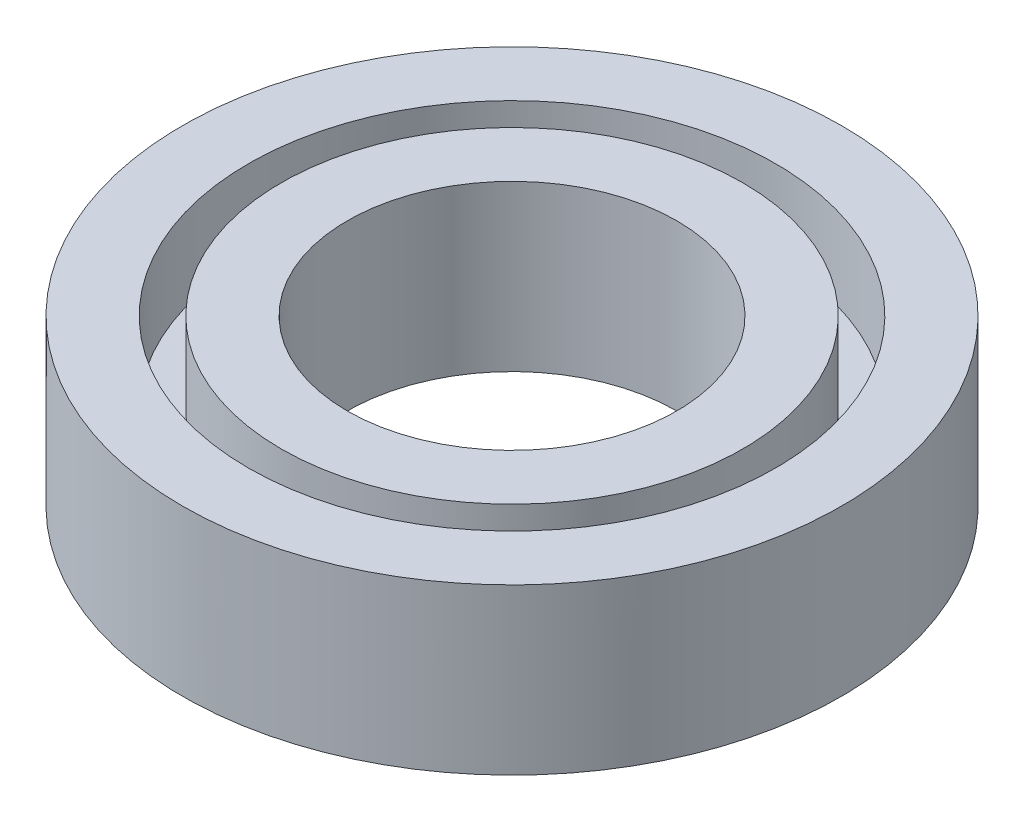
ISO-10303-21;
HEADER;
FILE_DESCRIPTION(('STEP AP214'),'2;1');
FILE_NAME('part.step','',(''),(''),'','','');
FILE_SCHEMA(('AUTOMOTIVE_DESIGN { 1 0 10303 214 1 1 1 1 }'));
ENDSEC;
DATA;
#1=APPLICATION_CONTEXT('core data for automotive mechanical design processes');
#2=APPLICATION_PROTOCOL_DEFINITION('international standard','automotive_design',2000,#1);
#3=PRODUCT_CONTEXT('',#1,'mechanical');
#4=PRODUCT('Part','Part','',(#3));
#5=PRODUCT_RELATED_PRODUCT_CATEGORY('part','',(#4));
#6=PRODUCT_DEFINITION_FORMATION('','',#4);
#7=PRODUCT_DEFINITION_CONTEXT('part definition',#1,'design');
#8=PRODUCT_DEFINITION('design','',#6,#7);
#9=PRODUCT_DEFINITION_SHAPE('','',#8);
#10=(LENGTH_UNIT() NAMED_UNIT(*) SI_UNIT(.MILLI.,.METRE.));
#11=(NAMED_UNIT(*) PLANE_ANGLE_UNIT() SI_UNIT($,.RADIAN.));
#12=(NAMED_UNIT(*) SI_UNIT($,.STERADIAN.) SOLID_ANGLE_UNIT());
#13=UNCERTAINTY_MEASURE_WITH_UNIT(LENGTH_MEASURE(1.E-05),#10,'distance_accuracy_value','');
#14=(GEOMETRIC_REPRESENTATION_CONTEXT(3) GLOBAL_UNCERTAINTY_ASSIGNED_CONTEXT((#13)) GLOBAL_UNIT_ASSIGNED_CONTEXT((#10,
#11,#12)) REPRESENTATION_CONTEXT('',''));
#15=CARTESIAN_POINT('',(0.,0.,0.));
#16=DIRECTION('',(0.,0.,1.));
#17=DIRECTION('',(1.,0.,0.));
#18=AXIS2_PLACEMENT_3D('',#15,#16,#17);
#19=CARTESIAN_POINT('',(0.,3.,0.));
#20=DIRECTION('',(0.,-1.,0.));
#21=DIRECTION('',(0.,0.,-1.));
#22=AXIS2_PLACEMENT_3D('',#19,#20,#21);
#23=CYLINDRICAL_SURFACE('',#22,4.);
#24=CARTESIAN_POINT('',(0.,3.,0.));
#25=DIRECTION('',(0.,1.,0.));
#26=DIRECTION('',(0.,0.,1.));
#27=AXIS2_PLACEMENT_3D('',#24,#25,#26);
#28=CIRCLE('',#27,4.);
#29=CARTESIAN_POINT('',(0.,3.,4.));
#30=VERTEX_POINT('',#29);
#31=EDGE_CURVE('E10',#30,#30,#28,.T.);
#32=ORIENTED_EDGE('',*,*,#31,.F.);
#33=EDGE_LOOP('',(#32));
#34=FACE_BOUND('',#33,.T.);
#35=CARTESIAN_POINT('',(0.,1.,0.));
#36=DIRECTION('',(0.,-1.,0.));
#37=DIRECTION('',(0.,0.,-1.));
#38=AXIS2_PLACEMENT_3D('',#35,#36,#37);
#39=CIRCLE('',#38,4.);
#40=CARTESIAN_POINT('',(0.,1.,-4.));
#41=VERTEX_POINT('',#40);
#42=EDGE_CURVE('E62',#41,#41,#39,.T.);
#43=ORIENTED_EDGE('',*,*,#42,.F.);
#44=EDGE_LOOP('',(#43));
#45=FACE_BOUND('',#44,.T.);
#46=ADVANCED_FACE('F39',(#34,#45),#23,.T.);
#47=CARTESIAN_POINT('',(0.,3.,0.));
#48=DIRECTION('',(0.,-1.,0.));
#49=DIRECTION('',(0.,0.,-1.));
#50=AXIS2_PLACEMENT_3D('',#47,#48,#49);
#51=CYLINDRICAL_SURFACE('',#50,2.);
#52=CARTESIAN_POINT('',(0.,3.,0.));
#53=DIRECTION('',(0.,1.,0.));
#54=DIRECTION('',(0.,0.,1.));
#55=AXIS2_PLACEMENT_3D('',#52,#53,#54);
#56=CIRCLE('',#55,2.);
#57=CARTESIAN_POINT('',(0.,3.,2.));
#58=VERTEX_POINT('',#57);
#59=EDGE_CURVE('E45',#58,#58,#56,.T.);
#60=ORIENTED_EDGE('',*,*,#59,.T.);
#61=EDGE_LOOP('',(#60));
#62=FACE_BOUND('',#61,.T.);
#63=CARTESIAN_POINT('',(0.,1.,0.));
#64=DIRECTION('',(0.,-1.,0.));
#65=DIRECTION('',(0.,0.,-1.));
#66=AXIS2_PLACEMENT_3D('',#63,#64,#65);
#67=CIRCLE('',#66,2.);
#68=CARTESIAN_POINT('',(0.,1.,-2.));
#69=VERTEX_POINT('',#68);
#70=EDGE_CURVE('E67',#69,#69,#67,.T.);
#71=ORIENTED_EDGE('',*,*,#70,.T.);
#72=EDGE_LOOP('',(#71));
#73=FACE_BOUND('',#72,.T.);
#74=ADVANCED_FACE('F71',(#62,#73),#51,.F.);
#75=CARTESIAN_POINT('',(0.,3.,0.));
#76=DIRECTION('',(0.,1.,0.));
#77=DIRECTION('',(0.,0.,1.));
#78=AXIS2_PLACEMENT_3D('',#75,#76,#77);
#79=PLANE('',#78);
#80=ORIENTED_EDGE('',*,*,#59,.F.);
#81=EDGE_LOOP('',(#80));
#82=FACE_BOUND('',#81,.T.);
#83=CARTESIAN_POINT('',(0.,3.,0.));
#84=DIRECTION('',(0.,1.,0.));
#85=DIRECTION('',(0.,0.,1.));
#86=AXIS2_PLACEMENT_3D('',#83,#84,#85);
#87=CIRCLE('',#86,2.8);
#88=CARTESIAN_POINT('',(0.,3.,2.8));
#89=VERTEX_POINT('',#88);
#90=EDGE_CURVE('E59',#89,#89,#87,.T.);
#91=ORIENTED_EDGE('',*,*,#90,.T.);
#92=EDGE_LOOP('',(#91));
#93=FACE_BOUND('',#92,.T.);
#94=ADVANCED_FACE('F85',(#82,#93),#79,.T.);
#95=CARTESIAN_POINT('',(0.,3.,0.));
#96=DIRECTION('',(0.,1.,0.));
#97=DIRECTION('',(0.,0.,1.));
#98=AXIS2_PLACEMENT_3D('',#95,#96,#97);
#99=CIRCLE('',#98,3.2);
#100=CARTESIAN_POINT('',(0.,3.,3.2));
#101=VERTEX_POINT('',#100);
#102=EDGE_CURVE('E53',#101,#101,#99,.T.);
#103=ORIENTED_EDGE('',*,*,#102,.F.);
#104=EDGE_LOOP('',(#103));
#105=FACE_BOUND('',#104,.T.);
#106=ORIENTED_EDGE('',*,*,#31,.T.);
#107=EDGE_LOOP('',(#106));
#108=FACE_BOUND('',#107,.T.);
#109=ADVANCED_FACE('F90',(#105,#108),#79,.T.);
#110=CARTESIAN_POINT('',(0.,2.,0.));
#111=DIRECTION('',(0.,1.,0.));
#112=DIRECTION('',(0.,0.,1.));
#113=AXIS2_PLACEMENT_3D('',#110,#111,#112);
#114=CYLINDRICAL_SURFACE('',#113,3.2);
#115=CARTESIAN_POINT('',(0.,2.,0.));
#116=DIRECTION('',(0.,1.,0.));
#117=DIRECTION('',(0.,0.,1.));
#118=AXIS2_PLACEMENT_3D('',#115,#116,#117);
#119=CIRCLE('',#118,3.2);
#120=CARTESIAN_POINT('',(0.,2.,3.2));
#121=VERTEX_POINT('',#120);
#122=EDGE_CURVE('E49',#121,#121,#119,.T.);
#123=ORIENTED_EDGE('',*,*,#122,.F.);
#124=EDGE_LOOP('',(#123));
#125=FACE_BOUND('',#124,.T.);
#126=ORIENTED_EDGE('',*,*,#102,.T.);
#127=EDGE_LOOP('',(#126));
#128=FACE_BOUND('',#127,.T.);
#129=ADVANCED_FACE('F93',(#125,#128),#114,.F.);
#130=CARTESIAN_POINT('',(0.,2.,0.));
#131=DIRECTION('',(0.,1.,0.));
#132=DIRECTION('',(0.,0.,1.));
#133=AXIS2_PLACEMENT_3D('',#130,#131,#132);
#134=PLANE('',#133);
#135=CARTESIAN_POINT('',(0.,2.,0.));
#136=DIRECTION('',(0.,1.,0.));
#137=DIRECTION('',(0.,0.,1.));
#138=AXIS2_PLACEMENT_3D('',#135,#136,#137);
#139=CIRCLE('',#138,2.8);
#140=CARTESIAN_POINT('',(0.,2.,2.8));
#141=VERTEX_POINT('',#140);
#142=EDGE_CURVE('E57',#141,#141,#139,.T.);
#143=ORIENTED_EDGE('',*,*,#142,.F.);
#144=EDGE_LOOP('',(#143));
#145=FACE_BOUND('',#144,.T.);
#146=ORIENTED_EDGE('',*,*,#122,.T.);
#147=EDGE_LOOP('',(#146));
#148=FACE_BOUND('',#147,.T.);
#149=ADVANCED_FACE('F100',(#145,#148),#134,.T.);
#150=CARTESIAN_POINT('',(0.,2.,0.));
#151=DIRECTION('',(0.,1.,0.));
#152=DIRECTION('',(0.,0.,1.));
#153=AXIS2_PLACEMENT_3D('',#150,#151,#152);
#154=CYLINDRICAL_SURFACE('',#153,2.8);
#155=ORIENTED_EDGE('',*,*,#142,.T.);
#156=EDGE_LOOP('',(#155));
#157=FACE_BOUND('',#156,.T.);
#158=ORIENTED_EDGE('',*,*,#90,.F.);
#159=EDGE_LOOP('',(#158));
#160=FACE_BOUND('',#159,.T.);
#161=ADVANCED_FACE('F76',(#157,#160),#154,.T.);
#162=CARTESIAN_POINT('',(0.,1.,0.));
#163=DIRECTION('',(0.,-1.,0.));
#164=DIRECTION('',(0.,0.,-1.));
#165=AXIS2_PLACEMENT_3D('',#162,#163,#164);
#166=PLANE('',#165);
#167=ORIENTED_EDGE('',*,*,#70,.F.);
#168=EDGE_LOOP('',(#167));
#169=FACE_BOUND('',#168,.T.);
#170=ORIENTED_EDGE('',*,*,#42,.T.);
#171=EDGE_LOOP('',(#170));
#172=FACE_BOUND('',#171,.T.);
#173=ADVANCED_FACE('F73',(#169,#172),#166,.T.);
#174=CLOSED_SHELL('',(#46,#74,#94,#109,#129,#149,#161,#173));
#175=MANIFOLD_SOLID_BREP('B2',#174);
#176=ADVANCED_BREP_SHAPE_REPRESENTATION('',(#18,#175),#14);
#177=SHAPE_DEFINITION_REPRESENTATION(#9,#176);
ENDSEC;
END-ISO-10303-21;
